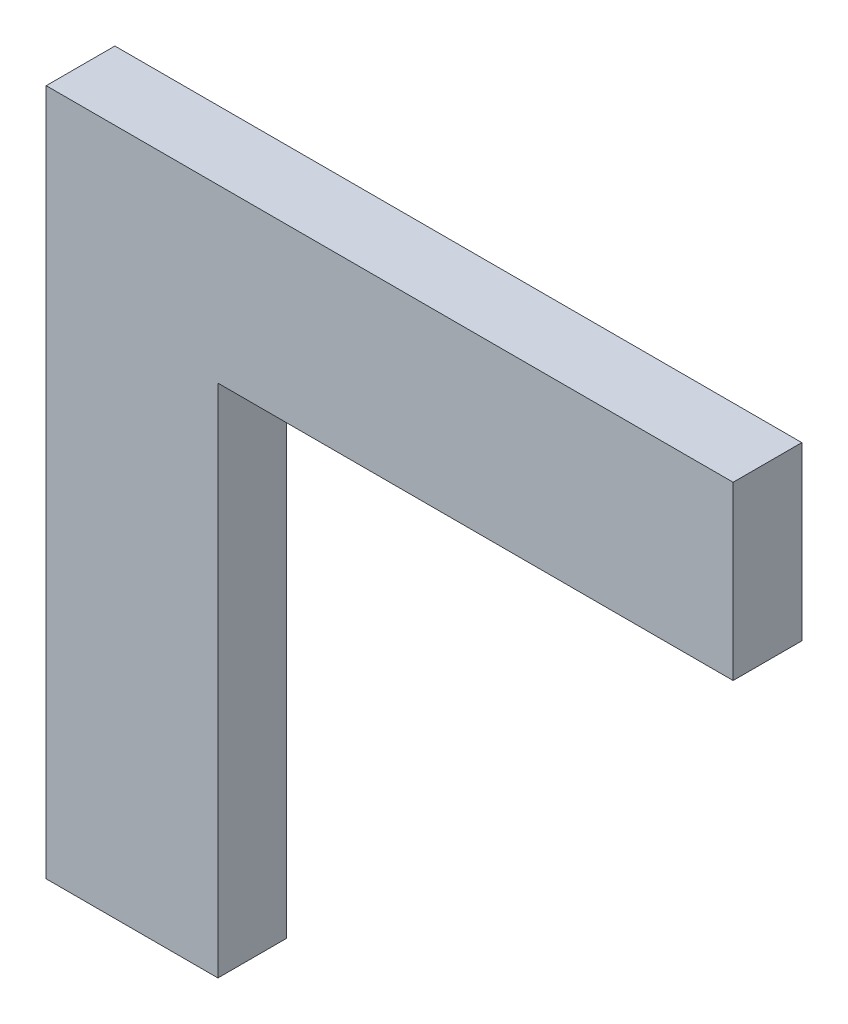
ISO-10303-21;
HEADER;
FILE_DESCRIPTION(('STEP AP214'),'2;1');
FILE_NAME('part.step','',(''),(''),'','','');
FILE_SCHEMA(('AUTOMOTIVE_DESIGN { 1 0 10303 214 1 1 1 1 }'));
ENDSEC;
DATA;
#1=APPLICATION_CONTEXT('core data for automotive mechanical design processes');
#2=APPLICATION_PROTOCOL_DEFINITION('international standard','automotive_design',2000,#1);
#3=PRODUCT_CONTEXT('',#1,'mechanical');
#4=PRODUCT('Part','Part','',(#3));
#5=PRODUCT_RELATED_PRODUCT_CATEGORY('part','',(#4));
#6=PRODUCT_DEFINITION_FORMATION('','',#4);
#7=PRODUCT_DEFINITION_CONTEXT('part definition',#1,'design');
#8=PRODUCT_DEFINITION('design','',#6,#7);
#9=PRODUCT_DEFINITION_SHAPE('','',#8);
#10=(LENGTH_UNIT() NAMED_UNIT(*) SI_UNIT(.MILLI.,.METRE.));
#11=(NAMED_UNIT(*) PLANE_ANGLE_UNIT() SI_UNIT($,.RADIAN.));
#12=(NAMED_UNIT(*) SI_UNIT($,.STERADIAN.) SOLID_ANGLE_UNIT());
#13=UNCERTAINTY_MEASURE_WITH_UNIT(LENGTH_MEASURE(1.E-05),#10,'distance_accuracy_value','');
#14=(GEOMETRIC_REPRESENTATION_CONTEXT(3) GLOBAL_UNCERTAINTY_ASSIGNED_CONTEXT((#13)) GLOBAL_UNIT_ASSIGNED_CONTEXT((#10,
#11,#12)) REPRESENTATION_CONTEXT('',''));
#15=CARTESIAN_POINT('',(0.,0.,0.));
#16=DIRECTION('',(0.,0.,1.));
#17=DIRECTION('',(1.,0.,0.));
#18=AXIS2_PLACEMENT_3D('',#15,#16,#17);
#19=CARTESIAN_POINT('',(-20.,0.,8.));
#20=DIRECTION('',(0.,1.,0.));
#21=DIRECTION('',(0.,0.,1.));
#22=AXIS2_PLACEMENT_3D('',#19,#20,#21);
#23=PLANE('',#22);
#24=DIRECTION('',(1.,0.,0.));
#25=VECTOR('',#24,1.);
#26=CARTESIAN_POINT('',(-20.,0.,0.));
#27=LINE('',#26,#25);
#28=CARTESIAN_POINT('',(-20.,0.,0.));
#29=VERTEX_POINT('',#28);
#30=CARTESIAN_POINT('',(0.,0.,0.));
#31=VERTEX_POINT('',#30);
#32=EDGE_CURVE('E117',#29,#31,#27,.T.);
#33=ORIENTED_EDGE('',*,*,#32,.T.);
#34=DIRECTION('',(0.,0.,-1.));
#35=VECTOR('',#34,1.);
#36=CARTESIAN_POINT('',(0.,0.,8.));
#37=LINE('',#36,#35);
#38=CARTESIAN_POINT('',(0.,0.,8.));
#39=VERTEX_POINT('',#38);
#40=EDGE_CURVE('E11',#39,#31,#37,.T.);
#41=ORIENTED_EDGE('',*,*,#40,.F.);
#42=DIRECTION('',(1.,0.,0.));
#43=VECTOR('',#42,1.);
#44=CARTESIAN_POINT('',(-20.,0.,8.));
#45=LINE('',#44,#43);
#46=CARTESIAN_POINT('',(-20.,0.,8.));
#47=VERTEX_POINT('',#46);
#48=EDGE_CURVE('E127',#47,#39,#45,.T.);
#49=ORIENTED_EDGE('',*,*,#48,.F.);
#50=DIRECTION('',(0.,0.,-1.));
#51=VECTOR('',#50,1.);
#52=CARTESIAN_POINT('',(-20.,0.,8.));
#53=LINE('',#52,#51);
#54=EDGE_CURVE('E113',#47,#29,#53,.T.);
#55=ORIENTED_EDGE('',*,*,#54,.T.);
#56=EDGE_LOOP('',(#33,#41,#49,#55));
#57=FACE_BOUND('',#56,.T.);
#58=ADVANCED_FACE('F33',(#57),#23,.F.);
#59=CARTESIAN_POINT('',(0.,0.,8.));
#60=DIRECTION('',(-1.,0.,0.));
#61=DIRECTION('',(0.,0.,1.));
#62=AXIS2_PLACEMENT_3D('',#59,#60,#61);
#63=PLANE('',#62);
#64=DIRECTION('',(0.,1.,0.));
#65=VECTOR('',#64,1.);
#66=CARTESIAN_POINT('',(0.,0.,0.));
#67=LINE('',#66,#65);
#68=CARTESIAN_POINT('',(0.,60.,0.));
#69=VERTEX_POINT('',#68);
#70=EDGE_CURVE('E120',#31,#69,#67,.T.);
#71=ORIENTED_EDGE('',*,*,#70,.T.);
#72=DIRECTION('',(0.,0.,-1.));
#73=VECTOR('',#72,1.);
#74=CARTESIAN_POINT('',(0.,60.,8.));
#75=LINE('',#74,#73);
#76=CARTESIAN_POINT('',(0.,60.,8.));
#77=VERTEX_POINT('',#76);
#78=EDGE_CURVE('E41',#77,#69,#75,.T.);
#79=ORIENTED_EDGE('',*,*,#78,.F.);
#80=DIRECTION('',(0.,1.,0.));
#81=VECTOR('',#80,1.);
#82=CARTESIAN_POINT('',(0.,0.,8.));
#83=LINE('',#82,#81);
#84=EDGE_CURVE('E86',#39,#77,#83,.T.);
#85=ORIENTED_EDGE('',*,*,#84,.F.);
#86=ORIENTED_EDGE('',*,*,#40,.T.);
#87=EDGE_LOOP('',(#71,#79,#85,#86));
#88=FACE_BOUND('',#87,.T.);
#89=ADVANCED_FACE('F151',(#88),#63,.F.);
#90=CARTESIAN_POINT('',(0.,60.,8.));
#91=DIRECTION('',(0.,1.,0.));
#92=DIRECTION('',(0.,0.,1.));
#93=AXIS2_PLACEMENT_3D('',#90,#91,#92);
#94=PLANE('',#93);
#95=DIRECTION('',(1.,0.,0.));
#96=VECTOR('',#95,1.);
#97=CARTESIAN_POINT('',(0.,60.,0.));
#98=LINE('',#97,#96);
#99=CARTESIAN_POINT('',(60.,60.,0.));
#100=VERTEX_POINT('',#99);
#101=EDGE_CURVE('E122',#69,#100,#98,.T.);
#102=ORIENTED_EDGE('',*,*,#101,.T.);
#103=DIRECTION('',(0.,0.,-1.));
#104=VECTOR('',#103,1.);
#105=CARTESIAN_POINT('',(60.,60.,8.));
#106=LINE('',#105,#104);
#107=CARTESIAN_POINT('',(60.,60.,8.));
#108=VERTEX_POINT('',#107);
#109=EDGE_CURVE('E108',#108,#100,#106,.T.);
#110=ORIENTED_EDGE('',*,*,#109,.F.);
#111=DIRECTION('',(1.,0.,0.));
#112=VECTOR('',#111,1.);
#113=CARTESIAN_POINT('',(0.,60.,8.));
#114=LINE('',#113,#112);
#115=EDGE_CURVE('E99',#77,#108,#114,.T.);
#116=ORIENTED_EDGE('',*,*,#115,.F.);
#117=ORIENTED_EDGE('',*,*,#78,.T.);
#118=EDGE_LOOP('',(#102,#110,#116,#117));
#119=FACE_BOUND('',#118,.T.);
#120=ADVANCED_FACE('F133',(#119),#94,.F.);
#121=CARTESIAN_POINT('',(60.,60.,8.));
#122=DIRECTION('',(-1.,0.,0.));
#123=DIRECTION('',(0.,0.,1.));
#124=AXIS2_PLACEMENT_3D('',#121,#122,#123);
#125=PLANE('',#124);
#126=DIRECTION('',(0.,1.,0.));
#127=VECTOR('',#126,1.);
#128=CARTESIAN_POINT('',(60.,60.,0.));
#129=LINE('',#128,#127);
#130=CARTESIAN_POINT('',(60.,80.,0.));
#131=VERTEX_POINT('',#130);
#132=EDGE_CURVE('E107',#100,#131,#129,.T.);
#133=ORIENTED_EDGE('',*,*,#132,.T.);
#134=DIRECTION('',(0.,0.,-1.));
#135=VECTOR('',#134,1.);
#136=CARTESIAN_POINT('',(60.,80.,8.));
#137=LINE('',#136,#135);
#138=CARTESIAN_POINT('',(60.,80.,8.));
#139=VERTEX_POINT('',#138);
#140=EDGE_CURVE('E104',#139,#131,#137,.T.);
#141=ORIENTED_EDGE('',*,*,#140,.F.);
#142=DIRECTION('',(0.,1.,0.));
#143=VECTOR('',#142,1.);
#144=CARTESIAN_POINT('',(60.,60.,8.));
#145=LINE('',#144,#143);
#146=EDGE_CURVE('E93',#108,#139,#145,.T.);
#147=ORIENTED_EDGE('',*,*,#146,.F.);
#148=ORIENTED_EDGE('',*,*,#109,.T.);
#149=EDGE_LOOP('',(#133,#141,#147,#148));
#150=FACE_BOUND('',#149,.T.);
#151=ADVANCED_FACE('F105',(#150),#125,.F.);
#152=CARTESIAN_POINT('',(60.,80.,8.));
#153=DIRECTION('',(0.,-1.,0.));
#154=DIRECTION('',(1.,0.,0.));
#155=AXIS2_PLACEMENT_3D('',#152,#153,#154);
#156=PLANE('',#155);
#157=DIRECTION('',(-1.,0.,0.));
#158=VECTOR('',#157,1.);
#159=CARTESIAN_POINT('',(60.,80.,0.));
#160=LINE('',#159,#158);
#161=CARTESIAN_POINT('',(-20.,80.,0.));
#162=VERTEX_POINT('',#161);
#163=EDGE_CURVE('E72',#131,#162,#160,.T.);
#164=ORIENTED_EDGE('',*,*,#163,.T.);
#165=DIRECTION('',(0.,0.,-1.));
#166=VECTOR('',#165,1.);
#167=CARTESIAN_POINT('',(-20.,80.,8.));
#168=LINE('',#167,#166);
#169=CARTESIAN_POINT('',(-20.,80.,8.));
#170=VERTEX_POINT('',#169);
#171=EDGE_CURVE('E109',#170,#162,#168,.T.);
#172=ORIENTED_EDGE('',*,*,#171,.F.);
#173=DIRECTION('',(-1.,0.,0.));
#174=VECTOR('',#173,1.);
#175=CARTESIAN_POINT('',(60.,80.,8.));
#176=LINE('',#175,#174);
#177=EDGE_CURVE('E97',#139,#170,#176,.T.);
#178=ORIENTED_EDGE('',*,*,#177,.F.);
#179=ORIENTED_EDGE('',*,*,#140,.T.);
#180=EDGE_LOOP('',(#164,#172,#178,#179));
#181=FACE_BOUND('',#180,.T.);
#182=ADVANCED_FACE('F111',(#181),#156,.F.);
#183=CARTESIAN_POINT('',(-20.,80.,8.));
#184=DIRECTION('',(1.,0.,0.));
#185=DIRECTION('',(0.,0.,-1.));
#186=AXIS2_PLACEMENT_3D('',#183,#184,#185);
#187=PLANE('',#186);
#188=DIRECTION('',(0.,-1.,0.));
#189=VECTOR('',#188,1.);
#190=CARTESIAN_POINT('',(-20.,80.,0.));
#191=LINE('',#190,#189);
#192=EDGE_CURVE('E78',#162,#29,#191,.T.);
#193=ORIENTED_EDGE('',*,*,#192,.T.);
#194=ORIENTED_EDGE('',*,*,#54,.F.);
#195=DIRECTION('',(0.,-1.,0.));
#196=VECTOR('',#195,1.);
#197=CARTESIAN_POINT('',(-20.,80.,8.));
#198=LINE('',#197,#196);
#199=EDGE_CURVE('E49',#170,#47,#198,.T.);
#200=ORIENTED_EDGE('',*,*,#199,.F.);
#201=ORIENTED_EDGE('',*,*,#171,.T.);
#202=EDGE_LOOP('',(#193,#194,#200,#201));
#203=FACE_BOUND('',#202,.T.);
#204=ADVANCED_FACE('F140',(#203),#187,.F.);
#205=CARTESIAN_POINT('',(0.,0.,8.));
#206=DIRECTION('',(0.,0.,1.));
#207=DIRECTION('',(1.,0.,0.));
#208=AXIS2_PLACEMENT_3D('',#205,#206,#207);
#209=PLANE('',#208);
#210=ORIENTED_EDGE('',*,*,#48,.T.);
#211=ORIENTED_EDGE('',*,*,#84,.T.);
#212=ORIENTED_EDGE('',*,*,#115,.T.);
#213=ORIENTED_EDGE('',*,*,#146,.T.);
#214=ORIENTED_EDGE('',*,*,#177,.T.);
#215=ORIENTED_EDGE('',*,*,#199,.T.);
#216=EDGE_LOOP('',(#210,#211,#212,#213,#214,#215));
#217=FACE_BOUND('',#216,.T.);
#218=ADVANCED_FACE('F95',(#217),#209,.T.);
#219=CARTESIAN_POINT('',(0.,0.,0.));
#220=DIRECTION('',(0.,0.,1.));
#221=DIRECTION('',(1.,0.,0.));
#222=AXIS2_PLACEMENT_3D('',#219,#220,#221);
#223=PLANE('',#222);
#224=ORIENTED_EDGE('',*,*,#32,.F.);
#225=ORIENTED_EDGE('',*,*,#192,.F.);
#226=ORIENTED_EDGE('',*,*,#163,.F.);
#227=ORIENTED_EDGE('',*,*,#132,.F.);
#228=ORIENTED_EDGE('',*,*,#101,.F.);
#229=ORIENTED_EDGE('',*,*,#70,.F.);
#230=EDGE_LOOP('',(#224,#225,#226,#227,#228,#229));
#231=FACE_BOUND('',#230,.T.);
#232=ADVANCED_FACE('F136',(#231),#223,.F.);
#233=CLOSED_SHELL('',(#58,#89,#120,#151,#182,#204,#218,#232));
#234=MANIFOLD_SOLID_BREP('B2',#233);
#235=ADVANCED_BREP_SHAPE_REPRESENTATION('',(#18,#234),#14);
#236=SHAPE_DEFINITION_REPRESENTATION(#9,#235);
ENDSEC;
END-ISO-10303-21;
